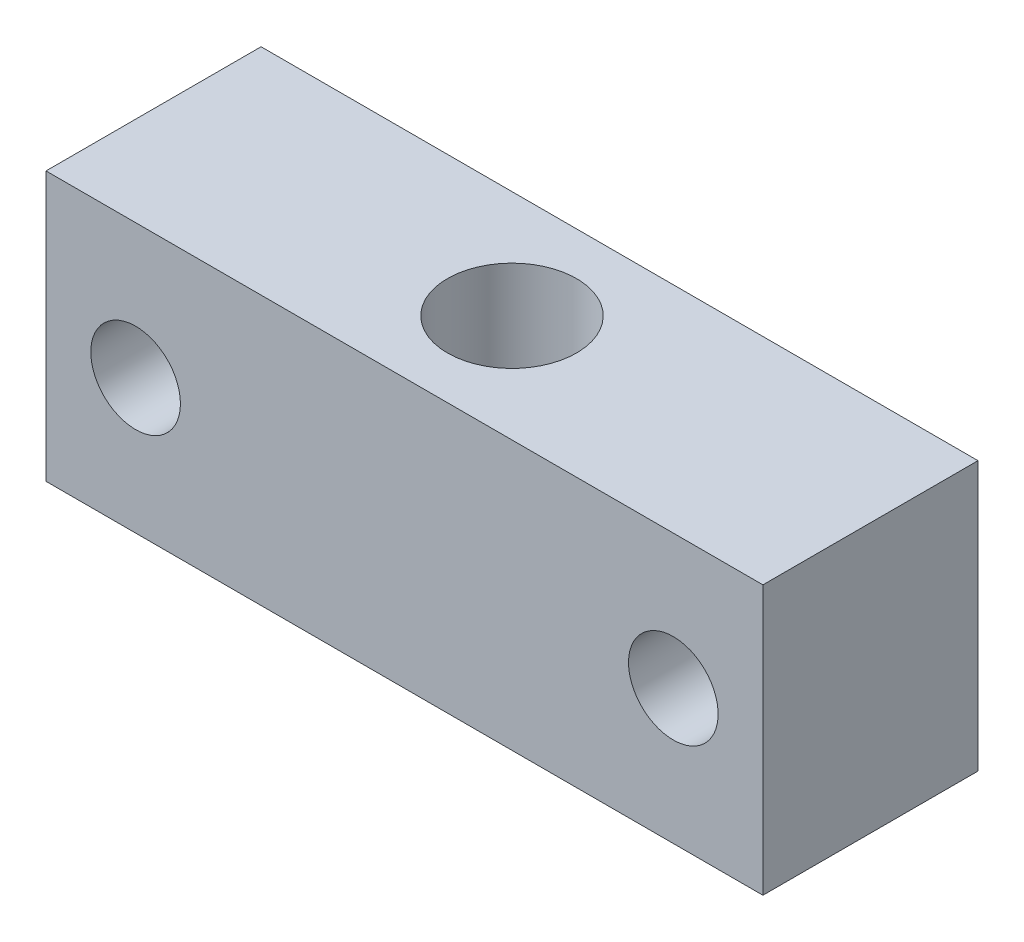
ISO-10303-21;
HEADER;
FILE_DESCRIPTION(('STEP AP214'),'2;1');
FILE_NAME('part.step','',(''),(''),'','','');
FILE_SCHEMA(('AUTOMOTIVE_DESIGN { 1 0 10303 214 1 1 1 1 }'));
ENDSEC;
DATA;
#1=APPLICATION_CONTEXT('core data for automotive mechanical design processes');
#2=APPLICATION_PROTOCOL_DEFINITION('international standard','automotive_design',2000,#1);
#3=PRODUCT_CONTEXT('',#1,'mechanical');
#4=PRODUCT('Part','Part','',(#3));
#5=PRODUCT_RELATED_PRODUCT_CATEGORY('part','',(#4));
#6=PRODUCT_DEFINITION_FORMATION('','',#4);
#7=PRODUCT_DEFINITION_CONTEXT('part definition',#1,'design');
#8=PRODUCT_DEFINITION('design','',#6,#7);
#9=PRODUCT_DEFINITION_SHAPE('','',#8);
#10=(LENGTH_UNIT() NAMED_UNIT(*) SI_UNIT(.MILLI.,.METRE.));
#11=(NAMED_UNIT(*) PLANE_ANGLE_UNIT() SI_UNIT($,.RADIAN.));
#12=(NAMED_UNIT(*) SI_UNIT($,.STERADIAN.) SOLID_ANGLE_UNIT());
#13=UNCERTAINTY_MEASURE_WITH_UNIT(LENGTH_MEASURE(1.E-05),#10,'distance_accuracy_value','');
#14=(GEOMETRIC_REPRESENTATION_CONTEXT(3) GLOBAL_UNCERTAINTY_ASSIGNED_CONTEXT((#13)) GLOBAL_UNIT_ASSIGNED_CONTEXT((#10,
#11,#12)) REPRESENTATION_CONTEXT('',''));
#15=CARTESIAN_POINT('',(0.,0.,0.));
#16=DIRECTION('',(0.,0.,1.));
#17=DIRECTION('',(1.,0.,0.));
#18=AXIS2_PLACEMENT_3D('',#15,#16,#17);
#19=CARTESIAN_POINT('',(0.,15.,0.));
#20=DIRECTION('',(0.,-1.,0.));
#21=DIRECTION('',(0.,0.,-1.));
#22=AXIS2_PLACEMENT_3D('',#19,#20,#21);
#23=PLANE('',#22);
#24=DIRECTION('',(0.,0.,-1.));
#25=VECTOR('',#24,1.);
#26=CARTESIAN_POINT('',(20.,15.,6.));
#27=LINE('',#26,#25);
#28=CARTESIAN_POINT('',(20.,15.,6.));
#29=VERTEX_POINT('',#28);
#30=CARTESIAN_POINT('',(20.,15.,-6.));
#31=VERTEX_POINT('',#30);
#32=EDGE_CURVE('E87',#29,#31,#27,.T.);
#33=ORIENTED_EDGE('',*,*,#32,.T.);
#34=DIRECTION('',(-1.,0.,0.));
#35=VECTOR('',#34,1.);
#36=CARTESIAN_POINT('',(-20.,15.,-6.));
#37=LINE('',#36,#35);
#38=CARTESIAN_POINT('',(-20.,15.,-6.));
#39=VERTEX_POINT('',#38);
#40=EDGE_CURVE('E82',#31,#39,#37,.T.);
#41=ORIENTED_EDGE('',*,*,#40,.T.);
#42=DIRECTION('',(0.,0.,1.));
#43=VECTOR('',#42,1.);
#44=CARTESIAN_POINT('',(-20.,15.,6.));
#45=LINE('',#44,#43);
#46=CARTESIAN_POINT('',(-20.,15.,6.));
#47=VERTEX_POINT('',#46);
#48=EDGE_CURVE('E85',#39,#47,#45,.T.);
#49=ORIENTED_EDGE('',*,*,#48,.T.);
#50=DIRECTION('',(1.,0.,0.));
#51=VECTOR('',#50,1.);
#52=CARTESIAN_POINT('',(-20.,15.,6.));
#53=LINE('',#52,#51);
#54=EDGE_CURVE('E52',#47,#29,#53,.T.);
#55=ORIENTED_EDGE('',*,*,#54,.T.);
#56=EDGE_LOOP('',(#33,#41,#49,#55));
#57=FACE_BOUND('',#56,.T.);
#58=CARTESIAN_POINT('',(0.,15.,0.));
#59=DIRECTION('',(0.,1.,0.));
#60=DIRECTION('',(0.,0.,1.));
#61=AXIS2_PLACEMENT_3D('',#58,#59,#60);
#62=CIRCLE('',#61,3.6);
#63=CARTESIAN_POINT('',(0.,15.,3.6));
#64=VERTEX_POINT('',#63);
#65=EDGE_CURVE('E102',#64,#64,#62,.T.);
#66=ORIENTED_EDGE('',*,*,#65,.F.);
#67=EDGE_LOOP('',(#66));
#68=FACE_BOUND('',#67,.T.);
#69=ADVANCED_FACE('F35',(#57,#68),#23,.F.);
#70=CARTESIAN_POINT('',(0.,0.,0.));
#71=DIRECTION('',(0.,-1.,0.));
#72=DIRECTION('',(0.,0.,-1.));
#73=AXIS2_PLACEMENT_3D('',#70,#71,#72);
#74=PLANE('',#73);
#75=DIRECTION('',(0.,0.,-1.));
#76=VECTOR('',#75,1.);
#77=CARTESIAN_POINT('',(20.,0.,6.));
#78=LINE('',#77,#76);
#79=CARTESIAN_POINT('',(20.,0.,6.));
#80=VERTEX_POINT('',#79);
#81=CARTESIAN_POINT('',(20.,0.,-6.));
#82=VERTEX_POINT('',#81);
#83=EDGE_CURVE('E99',#80,#82,#78,.T.);
#84=ORIENTED_EDGE('',*,*,#83,.F.);
#85=DIRECTION('',(1.,0.,0.));
#86=VECTOR('',#85,1.);
#87=CARTESIAN_POINT('',(-20.,0.,6.));
#88=LINE('',#87,#86);
#89=CARTESIAN_POINT('',(-20.,0.,6.));
#90=VERTEX_POINT('',#89);
#91=EDGE_CURVE('E75',#90,#80,#88,.T.);
#92=ORIENTED_EDGE('',*,*,#91,.F.);
#93=DIRECTION('',(0.,0.,1.));
#94=VECTOR('',#93,1.);
#95=CARTESIAN_POINT('',(-20.,0.,6.));
#96=LINE('',#95,#94);
#97=CARTESIAN_POINT('',(-20.,0.,-6.));
#98=VERTEX_POINT('',#97);
#99=EDGE_CURVE('E69',#98,#90,#96,.T.);
#100=ORIENTED_EDGE('',*,*,#99,.F.);
#101=DIRECTION('',(-1.,0.,0.));
#102=VECTOR('',#101,1.);
#103=CARTESIAN_POINT('',(-20.,0.,-6.));
#104=LINE('',#103,#102);
#105=EDGE_CURVE('E91',#82,#98,#104,.T.);
#106=ORIENTED_EDGE('',*,*,#105,.F.);
#107=EDGE_LOOP('',(#84,#92,#100,#106));
#108=FACE_BOUND('',#107,.T.);
#109=CARTESIAN_POINT('',(0.,0.,0.));
#110=DIRECTION('',(0.,1.,0.));
#111=DIRECTION('',(0.,0.,1.));
#112=AXIS2_PLACEMENT_3D('',#109,#110,#111);
#113=CIRCLE('',#112,3.6);
#114=CARTESIAN_POINT('',(0.,0.,3.6));
#115=VERTEX_POINT('',#114);
#116=EDGE_CURVE('E114',#115,#115,#113,.T.);
#117=ORIENTED_EDGE('',*,*,#116,.T.);
#118=EDGE_LOOP('',(#117));
#119=FACE_BOUND('',#118,.T.);
#120=ADVANCED_FACE('F110',(#108,#119),#74,.T.);
#121=CARTESIAN_POINT('',(20.,15.,6.));
#122=DIRECTION('',(-1.,0.,0.));
#123=DIRECTION('',(0.,0.,1.));
#124=AXIS2_PLACEMENT_3D('',#121,#122,#123);
#125=PLANE('',#124);
#126=ORIENTED_EDGE('',*,*,#83,.T.);
#127=DIRECTION('',(0.,-1.,0.));
#128=VECTOR('',#127,1.);
#129=CARTESIAN_POINT('',(20.,15.,-6.));
#130=LINE('',#129,#128);
#131=EDGE_CURVE('E11',#31,#82,#130,.T.);
#132=ORIENTED_EDGE('',*,*,#131,.F.);
#133=ORIENTED_EDGE('',*,*,#32,.F.);
#134=DIRECTION('',(0.,-1.,0.));
#135=VECTOR('',#134,1.);
#136=CARTESIAN_POINT('',(20.,15.,6.));
#137=LINE('',#136,#135);
#138=EDGE_CURVE('E95',#29,#80,#137,.T.);
#139=ORIENTED_EDGE('',*,*,#138,.T.);
#140=EDGE_LOOP('',(#126,#132,#133,#139));
#141=FACE_BOUND('',#140,.T.);
#142=ADVANCED_FACE('F37',(#141),#125,.F.);
#143=CARTESIAN_POINT('',(-20.,15.,-6.));
#144=DIRECTION('',(0.,0.,1.));
#145=DIRECTION('',(1.,0.,0.));
#146=AXIS2_PLACEMENT_3D('',#143,#144,#145);
#147=PLANE('',#146);
#148=CARTESIAN_POINT('',(15.,7.5,-6.));
#149=DIRECTION('',(0.,0.,1.));
#150=DIRECTION('',(-1.,0.,0.));
#151=AXIS2_PLACEMENT_3D('',#148,#149,#150);
#152=CIRCLE('',#151,2.5);
#153=CARTESIAN_POINT('',(12.5,7.5,-6.));
#154=VERTEX_POINT('',#153);
#155=EDGE_CURVE('E123',#154,#154,#152,.T.);
#156=ORIENTED_EDGE('',*,*,#155,.T.);
#157=EDGE_LOOP('',(#156));
#158=FACE_BOUND('',#157,.T.);
#159=CARTESIAN_POINT('',(-15.,7.5,-6.));
#160=DIRECTION('',(0.,0.,1.));
#161=DIRECTION('',(1.,0.,0.));
#162=AXIS2_PLACEMENT_3D('',#159,#160,#161);
#163=CIRCLE('',#162,2.5);
#164=CARTESIAN_POINT('',(-12.5,7.5,-6.));
#165=VERTEX_POINT('',#164);
#166=EDGE_CURVE('E117',#165,#165,#163,.T.);
#167=ORIENTED_EDGE('',*,*,#166,.T.);
#168=EDGE_LOOP('',(#167));
#169=FACE_BOUND('',#168,.T.);
#170=ORIENTED_EDGE('',*,*,#105,.T.);
#171=DIRECTION('',(0.,-1.,0.));
#172=VECTOR('',#171,1.);
#173=CARTESIAN_POINT('',(-20.,15.,-6.));
#174=LINE('',#173,#172);
#175=EDGE_CURVE('E44',#39,#98,#174,.T.);
#176=ORIENTED_EDGE('',*,*,#175,.F.);
#177=ORIENTED_EDGE('',*,*,#40,.F.);
#178=ORIENTED_EDGE('',*,*,#131,.T.);
#179=EDGE_LOOP('',(#170,#176,#177,#178));
#180=FACE_BOUND('',#179,.T.);
#181=ADVANCED_FACE('F90',(#158,#169,#180),#147,.F.);
#182=CARTESIAN_POINT('',(-20.,15.,6.));
#183=DIRECTION('',(1.,0.,0.));
#184=DIRECTION('',(0.,0.,-1.));
#185=AXIS2_PLACEMENT_3D('',#182,#183,#184);
#186=PLANE('',#185);
#187=ORIENTED_EDGE('',*,*,#99,.T.);
#188=DIRECTION('',(0.,-1.,0.));
#189=VECTOR('',#188,1.);
#190=CARTESIAN_POINT('',(-20.,15.,6.));
#191=LINE('',#190,#189);
#192=EDGE_CURVE('E92',#47,#90,#191,.T.);
#193=ORIENTED_EDGE('',*,*,#192,.F.);
#194=ORIENTED_EDGE('',*,*,#48,.F.);
#195=ORIENTED_EDGE('',*,*,#175,.T.);
#196=EDGE_LOOP('',(#187,#193,#194,#195));
#197=FACE_BOUND('',#196,.T.);
#198=ADVANCED_FACE('F93',(#197),#186,.F.);
#199=CARTESIAN_POINT('',(-20.,15.,6.));
#200=DIRECTION('',(0.,0.,-1.));
#201=DIRECTION('',(-1.,0.,0.));
#202=AXIS2_PLACEMENT_3D('',#199,#200,#201);
#203=PLANE('',#202);
#204=CARTESIAN_POINT('',(15.,7.5,6.));
#205=DIRECTION('',(0.,0.,1.));
#206=DIRECTION('',(-1.,0.,0.));
#207=AXIS2_PLACEMENT_3D('',#204,#205,#206);
#208=CIRCLE('',#207,2.5);
#209=CARTESIAN_POINT('',(12.5,7.5,6.));
#210=VERTEX_POINT('',#209);
#211=EDGE_CURVE('E126',#210,#210,#208,.T.);
#212=ORIENTED_EDGE('',*,*,#211,.F.);
#213=EDGE_LOOP('',(#212));
#214=FACE_BOUND('',#213,.T.);
#215=CARTESIAN_POINT('',(-15.,7.5,6.));
#216=DIRECTION('',(0.,0.,1.));
#217=DIRECTION('',(1.,0.,0.));
#218=AXIS2_PLACEMENT_3D('',#215,#216,#217);
#219=CIRCLE('',#218,2.5);
#220=CARTESIAN_POINT('',(-12.5,7.5,6.));
#221=VERTEX_POINT('',#220);
#222=EDGE_CURVE('E120',#221,#221,#219,.T.);
#223=ORIENTED_EDGE('',*,*,#222,.F.);
#224=EDGE_LOOP('',(#223));
#225=FACE_BOUND('',#224,.T.);
#226=ORIENTED_EDGE('',*,*,#91,.T.);
#227=ORIENTED_EDGE('',*,*,#138,.F.);
#228=ORIENTED_EDGE('',*,*,#54,.F.);
#229=ORIENTED_EDGE('',*,*,#192,.T.);
#230=EDGE_LOOP('',(#226,#227,#228,#229));
#231=FACE_BOUND('',#230,.T.);
#232=ADVANCED_FACE('F107',(#214,#225,#231),#203,.F.);
#233=CARTESIAN_POINT('',(0.,15.,0.));
#234=DIRECTION('',(0.,-1.,0.));
#235=DIRECTION('',(0.,0.,-1.));
#236=AXIS2_PLACEMENT_3D('',#233,#234,#235);
#237=CYLINDRICAL_SURFACE('',#236,3.6);
#238=ORIENTED_EDGE('',*,*,#65,.T.);
#239=EDGE_LOOP('',(#238));
#240=FACE_BOUND('',#239,.T.);
#241=ORIENTED_EDGE('',*,*,#116,.F.);
#242=EDGE_LOOP('',(#241));
#243=FACE_BOUND('',#242,.T.);
#244=ADVANCED_FACE('F143',(#240,#243),#237,.F.);
#245=CARTESIAN_POINT('',(-15.,7.5,-6.));
#246=DIRECTION('',(0.,0.,1.));
#247=DIRECTION('',(1.,0.,0.));
#248=AXIS2_PLACEMENT_3D('',#245,#246,#247);
#249=CYLINDRICAL_SURFACE('',#248,2.5);
#250=ORIENTED_EDGE('',*,*,#166,.F.);
#251=EDGE_LOOP('',(#250));
#252=FACE_BOUND('',#251,.T.);
#253=ORIENTED_EDGE('',*,*,#222,.T.);
#254=EDGE_LOOP('',(#253));
#255=FACE_BOUND('',#254,.T.);
#256=ADVANCED_FACE('F137',(#252,#255),#249,.F.);
#257=CARTESIAN_POINT('',(15.,7.5,-6.));
#258=DIRECTION('',(0.,0.,1.));
#259=DIRECTION('',(1.,0.,0.));
#260=AXIS2_PLACEMENT_3D('',#257,#258,#259);
#261=CYLINDRICAL_SURFACE('',#260,2.5);
#262=ORIENTED_EDGE('',*,*,#155,.F.);
#263=EDGE_LOOP('',(#262));
#264=FACE_BOUND('',#263,.T.);
#265=ORIENTED_EDGE('',*,*,#211,.T.);
#266=EDGE_LOOP('',(#265));
#267=FACE_BOUND('',#266,.T.);
#268=ADVANCED_FACE('F134',(#264,#267),#261,.F.);
#269=CLOSED_SHELL('',(#69,#120,#142,#181,#198,#232,#244,#256,#268));
#270=MANIFOLD_SOLID_BREP('B2',#269);
#271=ADVANCED_BREP_SHAPE_REPRESENTATION('',(#18,#270),#14);
#272=SHAPE_DEFINITION_REPRESENTATION(#9,#271);
ENDSEC;
END-ISO-10303-21;
